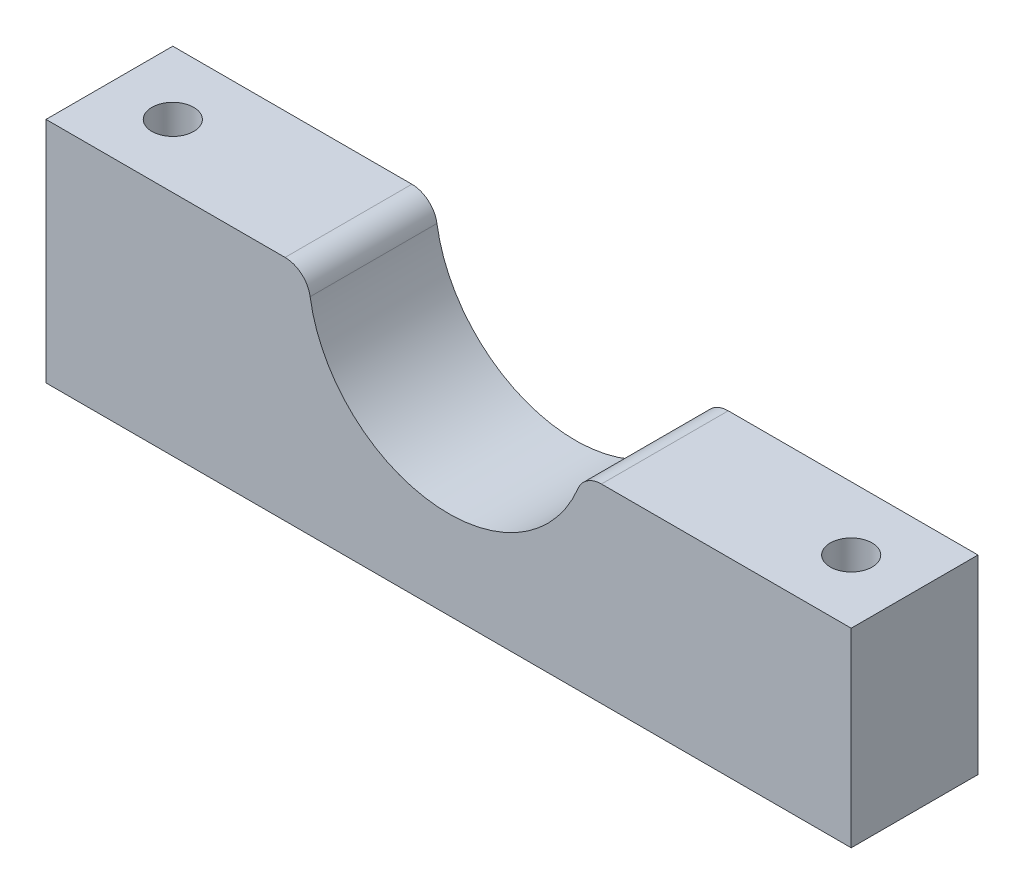
ISO-10303-21;
HEADER;
FILE_DESCRIPTION(('STEP AP214'),'2;1');
FILE_NAME('part.step','',(''),(''),'','','');
FILE_SCHEMA(('AUTOMOTIVE_DESIGN { 1 0 10303 214 1 1 1 1 }'));
ENDSEC;
DATA;
#1=APPLICATION_CONTEXT('core data for automotive mechanical design processes');
#2=APPLICATION_PROTOCOL_DEFINITION('international standard','automotive_design',2000,#1);
#3=PRODUCT_CONTEXT('',#1,'mechanical');
#4=PRODUCT('Part','Part','',(#3));
#5=PRODUCT_RELATED_PRODUCT_CATEGORY('part','',(#4));
#6=PRODUCT_DEFINITION_FORMATION('','',#4);
#7=PRODUCT_DEFINITION_CONTEXT('part definition',#1,'design');
#8=PRODUCT_DEFINITION('design','',#6,#7);
#9=PRODUCT_DEFINITION_SHAPE('','',#8);
#10=(LENGTH_UNIT() NAMED_UNIT(*) SI_UNIT(.MILLI.,.METRE.));
#11=(NAMED_UNIT(*) PLANE_ANGLE_UNIT() SI_UNIT($,.RADIAN.));
#12=(NAMED_UNIT(*) SI_UNIT($,.STERADIAN.) SOLID_ANGLE_UNIT());
#13=UNCERTAINTY_MEASURE_WITH_UNIT(LENGTH_MEASURE(1.E-05),#10,'distance_accuracy_value','');
#14=(GEOMETRIC_REPRESENTATION_CONTEXT(3) GLOBAL_UNCERTAINTY_ASSIGNED_CONTEXT((#13)) GLOBAL_UNIT_ASSIGNED_CONTEXT((#10,
#11,#12)) REPRESENTATION_CONTEXT('',''));
#15=CARTESIAN_POINT('',(0.,0.,0.));
#16=DIRECTION('',(0.,0.,1.));
#17=DIRECTION('',(1.,0.,0.));
#18=AXIS2_PLACEMENT_3D('',#15,#16,#17);
#19=CARTESIAN_POINT('',(31.75,-3.,10.));
#20=DIRECTION('',(-1.,0.,0.));
#21=DIRECTION('',(0.,0.,1.));
#22=AXIS2_PLACEMENT_3D('',#19,#20,#21);
#23=PLANE('',#22);
#24=DIRECTION('',(0.,1.,0.));
#25=VECTOR('',#24,1.);
#26=CARTESIAN_POINT('',(31.75,-3.,0.));
#27=LINE('',#26,#25);
#28=CARTESIAN_POINT('',(31.75,-18.,0.));
#29=VERTEX_POINT('',#28);
#30=CARTESIAN_POINT('',(31.75,-3.,0.));
#31=VERTEX_POINT('',#30);
#32=EDGE_CURVE('E124',#29,#31,#27,.T.);
#33=ORIENTED_EDGE('',*,*,#32,.T.);
#34=DIRECTION('',(0.,0.,-1.));
#35=VECTOR('',#34,1.);
#36=CARTESIAN_POINT('',(31.75,-3.,10.));
#37=LINE('',#36,#35);
#38=CARTESIAN_POINT('',(31.75,-3.,10.));
#39=VERTEX_POINT('',#38);
#40=EDGE_CURVE('E108',#39,#31,#37,.T.);
#41=ORIENTED_EDGE('',*,*,#40,.F.);
#42=DIRECTION('',(0.,1.,0.));
#43=VECTOR('',#42,1.);
#44=CARTESIAN_POINT('',(31.75,-3.,10.));
#45=LINE('',#44,#43);
#46=CARTESIAN_POINT('',(31.75,-18.,10.));
#47=VERTEX_POINT('',#46);
#48=EDGE_CURVE('E112',#47,#39,#45,.T.);
#49=ORIENTED_EDGE('',*,*,#48,.F.);
#50=DIRECTION('',(0.,0.,-1.));
#51=VECTOR('',#50,1.);
#52=CARTESIAN_POINT('',(31.75,-18.,10.));
#53=LINE('',#52,#51);
#54=EDGE_CURVE('E168',#47,#29,#53,.T.);
#55=ORIENTED_EDGE('',*,*,#54,.T.);
#56=EDGE_LOOP('',(#33,#41,#49,#55));
#57=FACE_BOUND('',#56,.T.);
#58=ADVANCED_FACE('F39',(#57),#23,.F.);
#59=CARTESIAN_POINT('',(10.6349659143789,-3.,10.));
#60=DIRECTION('',(0.,-1.,0.));
#61=DIRECTION('',(0.,0.,-1.));
#62=AXIS2_PLACEMENT_3D('',#59,#60,#61);
#63=PLANE('',#62);
#64=CARTESIAN_POINT('',(26.75,-3.,5.));
#65=DIRECTION('',(0.,-1.,0.));
#66=DIRECTION('',(0.,0.,-1.));
#67=AXIS2_PLACEMENT_3D('',#64,#65,#66);
#68=CIRCLE('',#67,1.64999999999999);
#69=CARTESIAN_POINT('',(26.75,-3.,3.35000000000001));
#70=VERTEX_POINT('',#69);
#71=EDGE_CURVE('E160',#70,#70,#68,.T.);
#72=ORIENTED_EDGE('',*,*,#71,.T.);
#73=EDGE_LOOP('',(#72));
#74=FACE_BOUND('',#73,.T.);
#75=DIRECTION('',(-1.,0.,0.));
#76=VECTOR('',#75,1.);
#77=CARTESIAN_POINT('',(10.6349659143789,-3.,0.));
#78=LINE('',#77,#76);
#79=CARTESIAN_POINT('',(12.054148663427,-3.,0.));
#80=VERTEX_POINT('',#79);
#81=EDGE_CURVE('E155',#31,#80,#78,.T.);
#82=ORIENTED_EDGE('',*,*,#81,.T.);
#83=DIRECTION('',(0.,0.,-1.));
#84=VECTOR('',#83,1.);
#85=CARTESIAN_POINT('',(12.054148663427,-3.,10.));
#86=LINE('',#85,#84);
#87=CARTESIAN_POINT('',(12.054148663427,-3.,10.));
#88=VERTEX_POINT('',#87);
#89=EDGE_CURVE('E62',#80,#88,#86,.F.);
#90=ORIENTED_EDGE('',*,*,#89,.T.);
#91=DIRECTION('',(-1.,0.,0.));
#92=VECTOR('',#91,1.);
#93=CARTESIAN_POINT('',(10.6349659143789,-3.,10.));
#94=LINE('',#93,#92);
#95=EDGE_CURVE('E104',#39,#88,#94,.T.);
#96=ORIENTED_EDGE('',*,*,#95,.F.);
#97=ORIENTED_EDGE('',*,*,#40,.T.);
#98=EDGE_LOOP('',(#82,#90,#96,#97));
#99=FACE_BOUND('',#98,.T.);
#100=ADVANCED_FACE('F106',(#74,#99),#63,.F.);
#101=CARTESIAN_POINT('',(0.,0.,10.));
#102=DIRECTION('',(0.,0.,-1.));
#103=DIRECTION('',(-1.,0.,0.));
#104=AXIS2_PLACEMENT_3D('',#101,#102,#103);
#105=CYLINDRICAL_SURFACE('',#104,11.05);
#106=CARTESIAN_POINT('',(0.,0.,10.));
#107=DIRECTION('',(0.,0.,-1.));
#108=DIRECTION('',(1.,0.,0.));
#109=AXIS2_PLACEMENT_3D('',#106,#107,#108);
#110=CIRCLE('',#109,11.05);
#111=CARTESIAN_POINT('',(10.206769557921,-4.23371647509578,10.));
#112=VERTEX_POINT('',#111);
#113=CARTESIAN_POINT('',(-10.9194598387173,-1.69348659003831,10.));
#114=VERTEX_POINT('',#113);
#115=EDGE_CURVE('E111',#112,#114,#110,.T.);
#116=ORIENTED_EDGE('',*,*,#115,.F.);
#117=DIRECTION('',(0.,0.,-1.));
#118=VECTOR('',#117,1.);
#119=CARTESIAN_POINT('',(10.206769557921,-4.23371647509579,10.));
#120=LINE('',#119,#118);
#121=CARTESIAN_POINT('',(10.206769557921,-4.23371647509578,0.));
#122=VERTEX_POINT('',#121);
#123=EDGE_CURVE('E128',#112,#122,#120,.T.);
#124=ORIENTED_EDGE('',*,*,#123,.T.);
#125=CARTESIAN_POINT('',(0.,0.,0.));
#126=DIRECTION('',(0.,0.,-1.));
#127=DIRECTION('',(1.,0.,0.));
#128=AXIS2_PLACEMENT_3D('',#125,#126,#127);
#129=CIRCLE('',#128,11.05);
#130=CARTESIAN_POINT('',(-10.9194598387173,-1.69348659003831,0.));
#131=VERTEX_POINT('',#130);
#132=EDGE_CURVE('E156',#122,#131,#129,.T.);
#133=ORIENTED_EDGE('',*,*,#132,.T.);
#134=DIRECTION('',(0.,0.,-1.));
#135=VECTOR('',#134,1.);
#136=CARTESIAN_POINT('',(-10.9194598387173,-1.69348659003831,10.));
#137=LINE('',#136,#135);
#138=EDGE_CURVE('E125',#131,#114,#137,.F.);
#139=ORIENTED_EDGE('',*,*,#138,.T.);
#140=EDGE_LOOP('',(#116,#124,#133,#139));
#141=FACE_BOUND('',#140,.T.);
#142=ADVANCED_FACE('F146',(#141),#105,.F.);
#143=CARTESIAN_POINT('',(-31.75,0.,10.));
#144=DIRECTION('',(0.,-1.,0.));
#145=DIRECTION('',(0.,0.,-1.));
#146=AXIS2_PLACEMENT_3D('',#143,#144,#145);
#147=PLANE('',#146);
#148=CARTESIAN_POINT('',(-26.75,0.,5.));
#149=DIRECTION('',(0.,-1.,0.));
#150=DIRECTION('',(0.,0.,-1.));
#151=AXIS2_PLACEMENT_3D('',#148,#149,#150);
#152=CIRCLE('',#151,1.65);
#153=CARTESIAN_POINT('',(-26.75,0.,3.35));
#154=VERTEX_POINT('',#153);
#155=EDGE_CURVE('E223',#154,#154,#152,.T.);
#156=ORIENTED_EDGE('',*,*,#155,.T.);
#157=EDGE_LOOP('',(#156));
#158=FACE_BOUND('',#157,.T.);
#159=DIRECTION('',(-1.,0.,0.));
#160=VECTOR('',#159,1.);
#161=CARTESIAN_POINT('',(-31.75,0.,10.));
#162=LINE('',#161,#160);
#163=CARTESIAN_POINT('',(-12.8958326602046,0.,10.));
#164=VERTEX_POINT('',#163);
#165=CARTESIAN_POINT('',(-31.75,0.,10.));
#166=VERTEX_POINT('',#165);
#167=EDGE_CURVE('E150',#164,#166,#162,.T.);
#168=ORIENTED_EDGE('',*,*,#167,.F.);
#169=DIRECTION('',(0.,0.,-1.));
#170=VECTOR('',#169,1.);
#171=CARTESIAN_POINT('',(-12.8958326602046,0.,10.));
#172=LINE('',#171,#170);
#173=CARTESIAN_POINT('',(-12.8958326602046,0.,0.));
#174=VERTEX_POINT('',#173);
#175=EDGE_CURVE('E11',#164,#174,#172,.T.);
#176=ORIENTED_EDGE('',*,*,#175,.T.);
#177=DIRECTION('',(-1.,0.,0.));
#178=VECTOR('',#177,1.);
#179=CARTESIAN_POINT('',(-31.75,0.,0.));
#180=LINE('',#179,#178);
#181=CARTESIAN_POINT('',(-31.75,0.,0.));
#182=VERTEX_POINT('',#181);
#183=EDGE_CURVE('E158',#174,#182,#180,.T.);
#184=ORIENTED_EDGE('',*,*,#183,.T.);
#185=DIRECTION('',(0.,0.,-1.));
#186=VECTOR('',#185,1.);
#187=CARTESIAN_POINT('',(-31.75,0.,10.));
#188=LINE('',#187,#186);
#189=EDGE_CURVE('E126',#166,#182,#188,.T.);
#190=ORIENTED_EDGE('',*,*,#189,.F.);
#191=EDGE_LOOP('',(#168,#176,#184,#190));
#192=FACE_BOUND('',#191,.T.);
#193=ADVANCED_FACE('F182',(#158,#192),#147,.F.);
#194=CARTESIAN_POINT('',(-31.75,0.,10.));
#195=DIRECTION('',(1.,0.,0.));
#196=DIRECTION('',(0.,1.,0.));
#197=AXIS2_PLACEMENT_3D('',#194,#195,#196);
#198=PLANE('',#197);
#199=DIRECTION('',(0.,-1.,0.));
#200=VECTOR('',#199,1.);
#201=CARTESIAN_POINT('',(-31.75,0.,0.));
#202=LINE('',#201,#200);
#203=CARTESIAN_POINT('',(-31.75,-18.,0.));
#204=VERTEX_POINT('',#203);
#205=EDGE_CURVE('E165',#182,#204,#202,.T.);
#206=ORIENTED_EDGE('',*,*,#205,.T.);
#207=DIRECTION('',(0.,0.,-1.));
#208=VECTOR('',#207,1.);
#209=CARTESIAN_POINT('',(-31.75,-18.,10.));
#210=LINE('',#209,#208);
#211=CARTESIAN_POINT('',(-31.75,-18.,10.));
#212=VERTEX_POINT('',#211);
#213=EDGE_CURVE('E131',#212,#204,#210,.T.);
#214=ORIENTED_EDGE('',*,*,#213,.F.);
#215=DIRECTION('',(0.,-1.,0.));
#216=VECTOR('',#215,1.);
#217=CARTESIAN_POINT('',(-31.75,0.,10.));
#218=LINE('',#217,#216);
#219=EDGE_CURVE('E180',#166,#212,#218,.T.);
#220=ORIENTED_EDGE('',*,*,#219,.F.);
#221=ORIENTED_EDGE('',*,*,#189,.T.);
#222=EDGE_LOOP('',(#206,#214,#220,#221));
#223=FACE_BOUND('',#222,.T.);
#224=ADVANCED_FACE('F178',(#223),#198,.F.);
#225=CARTESIAN_POINT('',(-31.75,-18.,10.));
#226=DIRECTION('',(0.,1.,0.));
#227=DIRECTION('',(0.,0.,1.));
#228=AXIS2_PLACEMENT_3D('',#225,#226,#227);
#229=PLANE('',#228);
#230=CARTESIAN_POINT('',(-26.75,-18.,5.));
#231=DIRECTION('',(0.,-1.,0.));
#232=DIRECTION('',(0.,0.,-1.));
#233=AXIS2_PLACEMENT_3D('',#230,#231,#232);
#234=CIRCLE('',#233,1.64999999999999);
#235=CARTESIAN_POINT('',(-26.75,-18.,3.35000000000001));
#236=VERTEX_POINT('',#235);
#237=EDGE_CURVE('E226',#236,#236,#234,.T.);
#238=ORIENTED_EDGE('',*,*,#237,.F.);
#239=EDGE_LOOP('',(#238));
#240=FACE_BOUND('',#239,.T.);
#241=CARTESIAN_POINT('',(26.75,-18.,5.));
#242=DIRECTION('',(0.,-1.,0.));
#243=DIRECTION('',(0.,0.,-1.));
#244=AXIS2_PLACEMENT_3D('',#241,#242,#243);
#245=CIRCLE('',#244,1.64999999999999);
#246=CARTESIAN_POINT('',(26.75,-18.,3.35000000000001));
#247=VERTEX_POINT('',#246);
#248=EDGE_CURVE('E228',#247,#247,#245,.T.);
#249=ORIENTED_EDGE('',*,*,#248,.F.);
#250=EDGE_LOOP('',(#249));
#251=FACE_BOUND('',#250,.T.);
#252=DIRECTION('',(1.,0.,0.));
#253=VECTOR('',#252,1.);
#254=CARTESIAN_POINT('',(-31.75,-18.,0.));
#255=LINE('',#254,#253);
#256=EDGE_CURVE('E121',#204,#29,#255,.T.);
#257=ORIENTED_EDGE('',*,*,#256,.T.);
#258=ORIENTED_EDGE('',*,*,#54,.F.);
#259=DIRECTION('',(1.,0.,0.));
#260=VECTOR('',#259,1.);
#261=CARTESIAN_POINT('',(-31.75,-18.,10.));
#262=LINE('',#261,#260);
#263=EDGE_CURVE('E117',#212,#47,#262,.T.);
#264=ORIENTED_EDGE('',*,*,#263,.F.);
#265=ORIENTED_EDGE('',*,*,#213,.T.);
#266=EDGE_LOOP('',(#257,#258,#264,#265));
#267=FACE_BOUND('',#266,.T.);
#268=ADVANCED_FACE('F173',(#240,#251,#267),#229,.F.);
#269=CARTESIAN_POINT('',(0.,0.,10.));
#270=DIRECTION('',(0.,0.,1.));
#271=DIRECTION('',(1.,0.,0.));
#272=AXIS2_PLACEMENT_3D('',#269,#270,#271);
#273=PLANE('',#272);
#274=ORIENTED_EDGE('',*,*,#95,.T.);
#275=CARTESIAN_POINT('',(12.054148663427,-5.,10.));
#276=DIRECTION('',(0.,0.,1.));
#277=DIRECTION('',(1.,0.,0.));
#278=AXIS2_PLACEMENT_3D('',#275,#276,#277);
#279=CIRCLE('',#278,2.);
#280=EDGE_CURVE('E47',#88,#112,#279,.T.);
#281=ORIENTED_EDGE('',*,*,#280,.T.);
#282=ORIENTED_EDGE('',*,*,#115,.T.);
#283=CARTESIAN_POINT('',(-12.8958326602046,-2.,10.));
#284=DIRECTION('',(0.,0.,1.));
#285=DIRECTION('',(1.,0.,0.));
#286=AXIS2_PLACEMENT_3D('',#283,#284,#285);
#287=CIRCLE('',#286,2.);
#288=EDGE_CURVE('E54',#114,#164,#287,.T.);
#289=ORIENTED_EDGE('',*,*,#288,.T.);
#290=ORIENTED_EDGE('',*,*,#167,.T.);
#291=ORIENTED_EDGE('',*,*,#219,.T.);
#292=ORIENTED_EDGE('',*,*,#263,.T.);
#293=ORIENTED_EDGE('',*,*,#48,.T.);
#294=EDGE_LOOP('',(#274,#281,#282,#289,#290,#291,#292,#293));
#295=FACE_BOUND('',#294,.T.);
#296=ADVANCED_FACE('F115',(#295),#273,.T.);
#297=CARTESIAN_POINT('',(0.,0.,0.));
#298=DIRECTION('',(0.,0.,1.));
#299=DIRECTION('',(1.,0.,0.));
#300=AXIS2_PLACEMENT_3D('',#297,#298,#299);
#301=PLANE('',#300);
#302=ORIENTED_EDGE('',*,*,#132,.F.);
#303=CARTESIAN_POINT('',(12.054148663427,-5.,0.));
#304=DIRECTION('',(0.,0.,1.));
#305=DIRECTION('',(1.,0.,0.));
#306=AXIS2_PLACEMENT_3D('',#303,#304,#305);
#307=CIRCLE('',#306,2.);
#308=EDGE_CURVE('E139',#122,#80,#307,.F.);
#309=ORIENTED_EDGE('',*,*,#308,.T.);
#310=ORIENTED_EDGE('',*,*,#81,.F.);
#311=ORIENTED_EDGE('',*,*,#32,.F.);
#312=ORIENTED_EDGE('',*,*,#256,.F.);
#313=ORIENTED_EDGE('',*,*,#205,.F.);
#314=ORIENTED_EDGE('',*,*,#183,.F.);
#315=CARTESIAN_POINT('',(-12.8958326602046,-2.,0.));
#316=DIRECTION('',(0.,0.,1.));
#317=DIRECTION('',(1.,0.,0.));
#318=AXIS2_PLACEMENT_3D('',#315,#316,#317);
#319=CIRCLE('',#318,2.);
#320=EDGE_CURVE('E137',#174,#131,#319,.F.);
#321=ORIENTED_EDGE('',*,*,#320,.T.);
#322=EDGE_LOOP('',(#302,#309,#310,#311,#312,#313,#314,#321));
#323=FACE_BOUND('',#322,.T.);
#324=ADVANCED_FACE('F154',(#323),#301,.F.);
#325=CARTESIAN_POINT('',(26.75,-18.,5.));
#326=DIRECTION('',(0.,-1.,0.));
#327=DIRECTION('',(0.,0.,-1.));
#328=AXIS2_PLACEMENT_3D('',#325,#326,#327);
#329=CYLINDRICAL_SURFACE('',#328,1.64999999999999);
#330=ORIENTED_EDGE('',*,*,#248,.T.);
#331=EDGE_LOOP('',(#330));
#332=FACE_BOUND('',#331,.T.);
#333=ORIENTED_EDGE('',*,*,#71,.F.);
#334=EDGE_LOOP('',(#333));
#335=FACE_BOUND('',#334,.T.);
#336=ADVANCED_FACE('F210',(#332,#335),#329,.F.);
#337=CARTESIAN_POINT('',(-26.75,-18.,5.));
#338=DIRECTION('',(0.,-1.,0.));
#339=DIRECTION('',(0.,0.,-1.));
#340=AXIS2_PLACEMENT_3D('',#337,#338,#339);
#341=CYLINDRICAL_SURFACE('',#340,1.64999999999999);
#342=ORIENTED_EDGE('',*,*,#155,.F.);
#343=EDGE_LOOP('',(#342));
#344=FACE_BOUND('',#343,.T.);
#345=ORIENTED_EDGE('',*,*,#237,.T.);
#346=EDGE_LOOP('',(#345));
#347=FACE_BOUND('',#346,.T.);
#348=ADVANCED_FACE('F189',(#344,#347),#341,.F.);
#349=CARTESIAN_POINT('',(12.054148663427,-5.,10.));
#350=DIRECTION('',(0.,0.,-1.));
#351=DIRECTION('',(-1.,0.,0.));
#352=AXIS2_PLACEMENT_3D('',#349,#350,#351);
#353=CYLINDRICAL_SURFACE('',#352,2.);
#354=ORIENTED_EDGE('',*,*,#280,.F.);
#355=ORIENTED_EDGE('',*,*,#89,.F.);
#356=ORIENTED_EDGE('',*,*,#308,.F.);
#357=ORIENTED_EDGE('',*,*,#123,.F.);
#358=EDGE_LOOP('',(#354,#355,#356,#357));
#359=FACE_BOUND('',#358,.T.);
#360=ADVANCED_FACE('F152',(#359),#353,.T.);
#361=CARTESIAN_POINT('',(-12.8958326602046,-2.,10.));
#362=DIRECTION('',(0.,0.,-1.));
#363=DIRECTION('',(-1.,0.,0.));
#364=AXIS2_PLACEMENT_3D('',#361,#362,#363);
#365=CYLINDRICAL_SURFACE('',#364,2.);
#366=ORIENTED_EDGE('',*,*,#288,.F.);
#367=ORIENTED_EDGE('',*,*,#138,.F.);
#368=ORIENTED_EDGE('',*,*,#320,.F.);
#369=ORIENTED_EDGE('',*,*,#175,.F.);
#370=EDGE_LOOP('',(#366,#367,#368,#369));
#371=FACE_BOUND('',#370,.T.);
#372=ADVANCED_FACE('F41',(#371),#365,.T.);
#373=CLOSED_SHELL('',(#58,#100,#142,#193,#224,#268,#296,#324,#336,#348,#360,#372));
#374=MANIFOLD_SOLID_BREP('B2',#373);
#375=ADVANCED_BREP_SHAPE_REPRESENTATION('',(#18,#374),#14);
#376=SHAPE_DEFINITION_REPRESENTATION(#9,#375);
ENDSEC;
END-ISO-10303-21;
